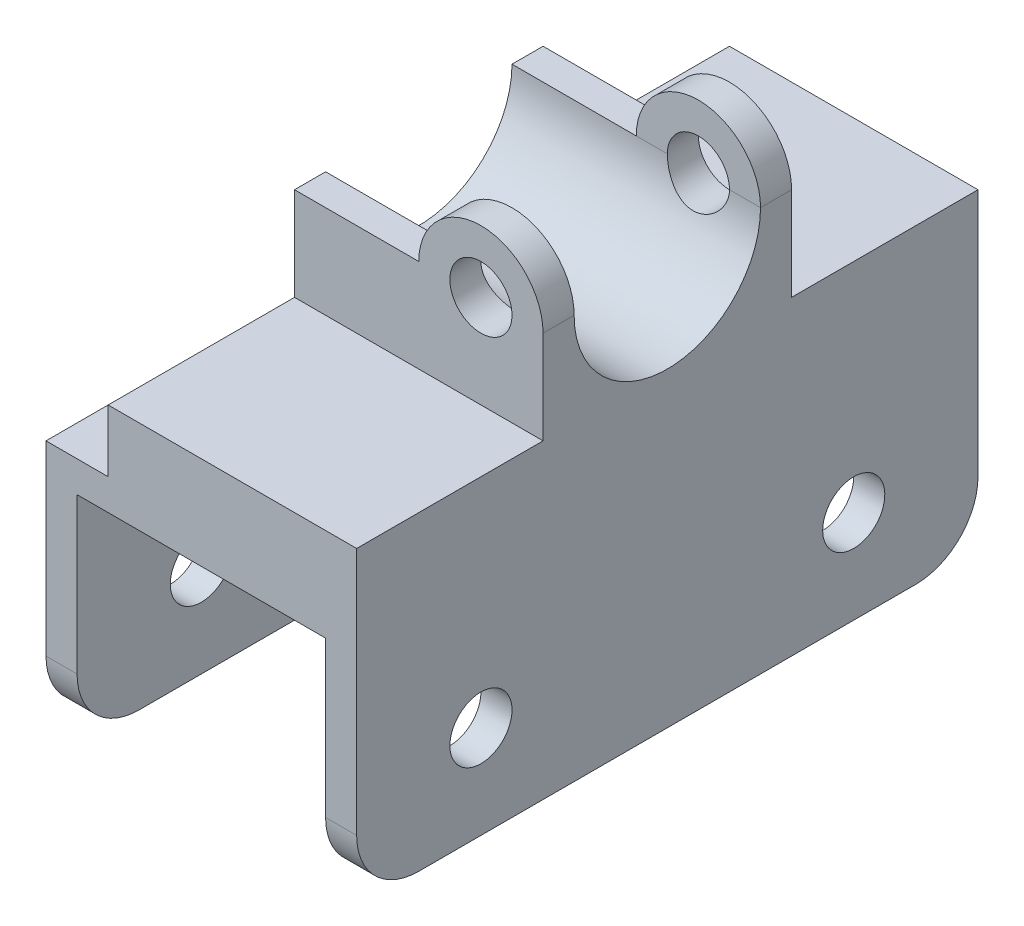
ISO-10303-21;
HEADER;
FILE_DESCRIPTION(('STEP AP214'),'2;1');
FILE_NAME('part.step','',(''),(''),'','','');
FILE_SCHEMA(('AUTOMOTIVE_DESIGN { 1 0 10303 214 1 1 1 1 }'));
ENDSEC;
DATA;
#1=APPLICATION_CONTEXT('core data for automotive mechanical design processes');
#2=APPLICATION_PROTOCOL_DEFINITION('international standard','automotive_design',2000,#1);
#3=PRODUCT_CONTEXT('',#1,'mechanical');
#4=PRODUCT('Part','Part','',(#3));
#5=PRODUCT_RELATED_PRODUCT_CATEGORY('part','',(#4));
#6=PRODUCT_DEFINITION_FORMATION('','',#4);
#7=PRODUCT_DEFINITION_CONTEXT('part definition',#1,'design');
#8=PRODUCT_DEFINITION('design','',#6,#7);
#9=PRODUCT_DEFINITION_SHAPE('','',#8);
#10=(LENGTH_UNIT() NAMED_UNIT(*) SI_UNIT(.MILLI.,.METRE.));
#11=(NAMED_UNIT(*) PLANE_ANGLE_UNIT() SI_UNIT($,.RADIAN.));
#12=(NAMED_UNIT(*) SI_UNIT($,.STERADIAN.) SOLID_ANGLE_UNIT());
#13=UNCERTAINTY_MEASURE_WITH_UNIT(LENGTH_MEASURE(1.E-05),#10,'distance_accuracy_value','');
#14=(GEOMETRIC_REPRESENTATION_CONTEXT(3) GLOBAL_UNCERTAINTY_ASSIGNED_CONTEXT((#13)) GLOBAL_UNIT_ASSIGNED_CONTEXT((#10,
#11,#12)) REPRESENTATION_CONTEXT('',''));
#15=CARTESIAN_POINT('',(0.,0.,0.));
#16=DIRECTION('',(0.,0.,1.));
#17=DIRECTION('',(1.,0.,0.));
#18=AXIS2_PLACEMENT_3D('',#15,#16,#17);
#19=CARTESIAN_POINT('',(40.,65.,100.));
#20=DIRECTION('',(0.,0.,-1.));
#21=DIRECTION('',(-1.,0.,0.));
#22=AXIS2_PLACEMENT_3D('',#19,#20,#21);
#23=CYLINDRICAL_SURFACE('',#22,9.99999999999999);
#24=DIRECTION('',(0.,0.,-1.));
#25=VECTOR('',#24,1.);
#26=CARTESIAN_POINT('',(50.,65.,100.));
#27=LINE('',#26,#25);
#28=CARTESIAN_POINT('',(50.,65.,70.));
#29=VERTEX_POINT('',#28);
#30=CARTESIAN_POINT('',(50.,65.,65.));
#31=VERTEX_POINT('',#30);
#32=EDGE_CURVE('E271',#29,#31,#27,.T.);
#33=ORIENTED_EDGE('',*,*,#32,.T.);
#34=CARTESIAN_POINT('',(40.,65.,65.));
#35=DIRECTION('',(0.,0.,1.));
#36=DIRECTION('',(1.,0.,0.));
#37=AXIS2_PLACEMENT_3D('',#34,#35,#36);
#38=CIRCLE('',#37,9.99999999999999);
#39=CARTESIAN_POINT('',(30.,65.,65.));
#40=VERTEX_POINT('',#39);
#41=EDGE_CURVE('E329',#31,#40,#38,.T.);
#42=ORIENTED_EDGE('',*,*,#41,.T.);
#43=DIRECTION('',(0.,0.,-1.));
#44=VECTOR('',#43,1.);
#45=CARTESIAN_POINT('',(30.,65.,100.));
#46=LINE('',#45,#44);
#47=CARTESIAN_POINT('',(30.,65.,70.));
#48=VERTEX_POINT('',#47);
#49=EDGE_CURVE('E266',#48,#40,#46,.T.);
#50=ORIENTED_EDGE('',*,*,#49,.F.);
#51=CARTESIAN_POINT('',(40.,65.,70.));
#52=DIRECTION('',(0.,0.,-1.));
#53=DIRECTION('',(-1.,0.,0.));
#54=AXIS2_PLACEMENT_3D('',#51,#52,#53);
#55=CIRCLE('',#54,9.99999999999999);
#56=EDGE_CURVE('E436',#48,#29,#55,.T.);
#57=ORIENTED_EDGE('',*,*,#56,.T.);
#58=EDGE_LOOP('',(#33,#42,#50,#57));
#59=FACE_BOUND('',#58,.T.);
#60=ADVANCED_FACE('F40',(#59),#23,.T.);
#61=CARTESIAN_POINT('',(0.,65.,100.));
#62=DIRECTION('',(0.,1.,0.));
#63=DIRECTION('',(0.,0.,1.));
#64=AXIS2_PLACEMENT_3D('',#61,#62,#63);
#65=PLANE('',#64);
#66=DIRECTION('',(0.,0.,1.));
#67=VECTOR('',#66,1.);
#68=CARTESIAN_POINT('',(10.,65.,-1.2E-05));
#69=LINE('',#68,#67);
#70=CARTESIAN_POINT('',(10.,65.,65.));
#71=VERTEX_POINT('',#70);
#72=CARTESIAN_POINT('',(10.,65.,70.));
#73=VERTEX_POINT('',#72);
#74=EDGE_CURVE('E56',#71,#73,#69,.T.);
#75=ORIENTED_EDGE('',*,*,#74,.T.);
#76=DIRECTION('',(-1.,0.,0.));
#77=VECTOR('',#76,1.);
#78=CARTESIAN_POINT('',(0.,65.,70.));
#79=LINE('',#78,#77);
#80=EDGE_CURVE('E283',#48,#73,#79,.T.);
#81=ORIENTED_EDGE('',*,*,#80,.F.);
#82=ORIENTED_EDGE('',*,*,#49,.T.);
#83=DIRECTION('',(1.,0.,0.));
#84=VECTOR('',#83,1.);
#85=CARTESIAN_POINT('',(-50.,65.,65.));
#86=LINE('',#85,#84);
#87=EDGE_CURVE('E452',#71,#40,#86,.T.);
#88=ORIENTED_EDGE('',*,*,#87,.F.);
#89=EDGE_LOOP('',(#75,#81,#82,#88));
#90=FACE_BOUND('',#89,.T.);
#91=ADVANCED_FACE('F573',(#90),#65,.T.);
#92=CARTESIAN_POINT('',(50.,0.,100.));
#93=DIRECTION('',(-1.,0.,0.));
#94=DIRECTION('',(0.,0.,1.));
#95=AXIS2_PLACEMENT_3D('',#92,#93,#94);
#96=PLANE('',#95);
#97=CARTESIAN_POINT('',(50.,15.,20.));
#98=DIRECTION('',(1.,0.,0.));
#99=DIRECTION('',(0.,0.,1.));
#100=AXIS2_PLACEMENT_3D('',#97,#98,#99);
#101=CIRCLE('',#100,5.);
#102=CARTESIAN_POINT('',(50.,15.,25.));
#103=VERTEX_POINT('',#102);
#104=EDGE_CURVE('E453',#103,#103,#101,.T.);
#105=ORIENTED_EDGE('',*,*,#104,.F.);
#106=EDGE_LOOP('',(#105));
#107=FACE_BOUND('',#106,.T.);
#108=CARTESIAN_POINT('',(50.,15.,80.));
#109=DIRECTION('',(1.,0.,0.));
#110=DIRECTION('',(0.,0.,-1.));
#111=AXIS2_PLACEMENT_3D('',#108,#109,#110);
#112=CIRCLE('',#111,5.);
#113=CARTESIAN_POINT('',(50.,15.,75.));
#114=VERTEX_POINT('',#113);
#115=EDGE_CURVE('E457',#114,#114,#112,.T.);
#116=ORIENTED_EDGE('',*,*,#115,.F.);
#117=EDGE_LOOP('',(#116));
#118=FACE_BOUND('',#117,.T.);
#119=DIRECTION('',(0.,0.,-1.));
#120=VECTOR('',#119,1.);
#121=CARTESIAN_POINT('',(50.,0.,100.));
#122=LINE('',#121,#120);
#123=CARTESIAN_POINT('',(50.,0.,90.));
#124=VERTEX_POINT('',#123);
#125=CARTESIAN_POINT('',(50.,0.,9.99999999999999));
#126=VERTEX_POINT('',#125);
#127=EDGE_CURVE('E246',#124,#126,#122,.T.);
#128=ORIENTED_EDGE('',*,*,#127,.T.);
#129=CARTESIAN_POINT('',(50.,10.,9.99999999999999));
#130=DIRECTION('',(-1.,0.,0.));
#131=DIRECTION('',(0.,0.,1.));
#132=AXIS2_PLACEMENT_3D('',#129,#130,#131);
#133=CIRCLE('',#132,10.);
#134=CARTESIAN_POINT('',(50.,10.,0.));
#135=VERTEX_POINT('',#134);
#136=EDGE_CURVE('E375',#126,#135,#133,.F.);
#137=ORIENTED_EDGE('',*,*,#136,.T.);
#138=DIRECTION('',(0.,1.,0.));
#139=VECTOR('',#138,1.);
#140=CARTESIAN_POINT('',(50.,0.,0.));
#141=LINE('',#140,#139);
#142=CARTESIAN_POINT('',(50.,50.,0.));
#143=VERTEX_POINT('',#142);
#144=EDGE_CURVE('E231',#135,#143,#141,.T.);
#145=ORIENTED_EDGE('',*,*,#144,.T.);
#146=DIRECTION('',(0.,0.,-1.));
#147=VECTOR('',#146,1.);
#148=CARTESIAN_POINT('',(50.,50.,0.));
#149=LINE('',#148,#147);
#150=CARTESIAN_POINT('',(50.,50.,30.));
#151=VERTEX_POINT('',#150);
#152=EDGE_CURVE('E467',#151,#143,#149,.T.);
#153=ORIENTED_EDGE('',*,*,#152,.F.);
#154=DIRECTION('',(0.,-1.,0.));
#155=VECTOR('',#154,1.);
#156=CARTESIAN_POINT('',(50.,75.,30.));
#157=LINE('',#156,#155);
#158=CARTESIAN_POINT('',(50.,65.,30.));
#159=VERTEX_POINT('',#158);
#160=EDGE_CURVE('E462',#159,#151,#157,.T.);
#161=ORIENTED_EDGE('',*,*,#160,.F.);
#162=CARTESIAN_POINT('',(50.,65.,35.));
#163=VERTEX_POINT('',#162);
#164=EDGE_CURVE('E267',#163,#159,#27,.T.);
#165=ORIENTED_EDGE('',*,*,#164,.F.);
#166=CARTESIAN_POINT('',(50.,65.,50.));
#167=DIRECTION('',(1.,0.,0.));
#168=DIRECTION('',(0.,0.,-1.));
#169=AXIS2_PLACEMENT_3D('',#166,#167,#168);
#170=CIRCLE('',#169,15.);
#171=EDGE_CURVE('E466',#31,#163,#170,.T.);
#172=ORIENTED_EDGE('',*,*,#171,.F.);
#173=ORIENTED_EDGE('',*,*,#32,.F.);
#174=DIRECTION('',(0.,1.,0.));
#175=VECTOR('',#174,1.);
#176=CARTESIAN_POINT('',(50.,75.,70.));
#177=LINE('',#176,#175);
#178=CARTESIAN_POINT('',(50.,50.,70.));
#179=VERTEX_POINT('',#178);
#180=EDGE_CURVE('E444',#179,#29,#177,.T.);
#181=ORIENTED_EDGE('',*,*,#180,.F.);
#182=DIRECTION('',(0.,0.,-1.));
#183=VECTOR('',#182,1.);
#184=CARTESIAN_POINT('',(50.,50.,100.));
#185=LINE('',#184,#183);
#186=CARTESIAN_POINT('',(50.,50.,100.));
#187=VERTEX_POINT('',#186);
#188=EDGE_CURVE('E448',#187,#179,#185,.T.);
#189=ORIENTED_EDGE('',*,*,#188,.F.);
#190=DIRECTION('',(0.,1.,0.));
#191=VECTOR('',#190,1.);
#192=CARTESIAN_POINT('',(50.,0.,100.));
#193=LINE('',#192,#191);
#194=CARTESIAN_POINT('',(50.,10.,100.));
#195=VERTEX_POINT('',#194);
#196=EDGE_CURVE('E245',#195,#187,#193,.T.);
#197=ORIENTED_EDGE('',*,*,#196,.F.);
#198=CARTESIAN_POINT('',(50.,10.,90.));
#199=DIRECTION('',(-1.,0.,0.));
#200=DIRECTION('',(0.,0.,1.));
#201=AXIS2_PLACEMENT_3D('',#198,#199,#200);
#202=CIRCLE('',#201,10.);
#203=EDGE_CURVE('E372',#195,#124,#202,.F.);
#204=ORIENTED_EDGE('',*,*,#203,.T.);
#205=EDGE_LOOP('',(#128,#137,#145,#153,#161,#165,#172,#173,#181,#189,#197,#204));
#206=FACE_BOUND('',#205,.T.);
#207=ADVANCED_FACE('F536',(#107,#118,#206),#96,.F.);
#208=ORIENTED_EDGE('',*,*,#164,.T.);
#209=CARTESIAN_POINT('',(40.,65.,30.));
#210=DIRECTION('',(0.,0.,1.));
#211=DIRECTION('',(0.,-1.,0.));
#212=AXIS2_PLACEMENT_3D('',#209,#210,#211);
#213=CIRCLE('',#212,9.99999999999999);
#214=CARTESIAN_POINT('',(30.,65.,30.));
#215=VERTEX_POINT('',#214);
#216=EDGE_CURVE('E335',#159,#215,#213,.T.);
#217=ORIENTED_EDGE('',*,*,#216,.T.);
#218=CARTESIAN_POINT('',(30.,65.,35.));
#219=VERTEX_POINT('',#218);
#220=EDGE_CURVE('E262',#219,#215,#46,.T.);
#221=ORIENTED_EDGE('',*,*,#220,.F.);
#222=CARTESIAN_POINT('',(40.,65.,35.));
#223=DIRECTION('',(0.,0.,-1.));
#224=DIRECTION('',(-1.,0.,0.));
#225=AXIS2_PLACEMENT_3D('',#222,#223,#224);
#226=CIRCLE('',#225,9.99999999999999);
#227=EDGE_CURVE('E433',#219,#163,#226,.T.);
#228=ORIENTED_EDGE('',*,*,#227,.T.);
#229=EDGE_LOOP('',(#208,#217,#221,#228));
#230=FACE_BOUND('',#229,.T.);
#231=ADVANCED_FACE('F576',(#230),#23,.T.);
#232=CARTESIAN_POINT('',(10.,65.,30.));
#233=VERTEX_POINT('',#232);
#234=CARTESIAN_POINT('',(10.,65.,35.));
#235=VERTEX_POINT('',#234);
#236=EDGE_CURVE('E518',#233,#235,#69,.T.);
#237=ORIENTED_EDGE('',*,*,#236,.T.);
#238=DIRECTION('',(1.,0.,0.));
#239=VECTOR('',#238,1.);
#240=CARTESIAN_POINT('',(-50.,65.,35.));
#241=LINE('',#240,#239);
#242=EDGE_CURVE('E479',#235,#219,#241,.T.);
#243=ORIENTED_EDGE('',*,*,#242,.T.);
#244=ORIENTED_EDGE('',*,*,#220,.T.);
#245=DIRECTION('',(1.,0.,0.));
#246=VECTOR('',#245,1.);
#247=CARTESIAN_POINT('',(0.,65.,30.));
#248=LINE('',#247,#246);
#249=EDGE_CURVE('E328',#233,#215,#248,.T.);
#250=ORIENTED_EDGE('',*,*,#249,.F.);
#251=EDGE_LOOP('',(#237,#243,#244,#250));
#252=FACE_BOUND('',#251,.T.);
#253=ADVANCED_FACE('F582',(#252),#65,.T.);
#254=CARTESIAN_POINT('',(0.,0.,100.));
#255=DIRECTION('',(-1.,0.,0.));
#256=DIRECTION('',(0.,0.,1.));
#257=AXIS2_PLACEMENT_3D('',#254,#255,#256);
#258=PLANE('',#257);
#259=DIRECTION('',(0.,0.,1.));
#260=VECTOR('',#259,1.);
#261=CARTESIAN_POINT('',(0.,40.,0.));
#262=LINE('',#261,#260);
#263=CARTESIAN_POINT('',(0.,40.,0.));
#264=VERTEX_POINT('',#263);
#265=CARTESIAN_POINT('',(0.,40.,100.));
#266=VERTEX_POINT('',#265);
#267=EDGE_CURVE('E205',#264,#266,#262,.T.);
#268=ORIENTED_EDGE('',*,*,#267,.F.);
#269=DIRECTION('',(0.,1.,0.));
#270=VECTOR('',#269,1.);
#271=CARTESIAN_POINT('',(0.,0.,0.));
#272=LINE('',#271,#270);
#273=CARTESIAN_POINT('',(0.,10.,0.));
#274=VERTEX_POINT('',#273);
#275=EDGE_CURVE('E219',#274,#264,#272,.T.);
#276=ORIENTED_EDGE('',*,*,#275,.F.);
#277=CARTESIAN_POINT('',(0.,10.,9.99999999999999));
#278=DIRECTION('',(-1.,0.,0.));
#279=DIRECTION('',(0.,0.,1.));
#280=AXIS2_PLACEMENT_3D('',#277,#278,#279);
#281=CIRCLE('',#280,10.);
#282=CARTESIAN_POINT('',(0.,0.,9.99999999999999));
#283=VERTEX_POINT('',#282);
#284=EDGE_CURVE('E362',#274,#283,#281,.T.);
#285=ORIENTED_EDGE('',*,*,#284,.T.);
#286=DIRECTION('',(0.,0.,-1.));
#287=VECTOR('',#286,1.);
#288=CARTESIAN_POINT('',(0.,0.,100.));
#289=LINE('',#288,#287);
#290=CARTESIAN_POINT('',(0.,0.,90.));
#291=VERTEX_POINT('',#290);
#292=EDGE_CURVE('E258',#291,#283,#289,.T.);
#293=ORIENTED_EDGE('',*,*,#292,.F.);
#294=CARTESIAN_POINT('',(0.,10.,90.));
#295=DIRECTION('',(-1.,0.,0.));
#296=DIRECTION('',(0.,0.,1.));
#297=AXIS2_PLACEMENT_3D('',#294,#295,#296);
#298=CIRCLE('',#297,10.);
#299=CARTESIAN_POINT('',(0.,10.,100.));
#300=VERTEX_POINT('',#299);
#301=EDGE_CURVE('E359',#291,#300,#298,.T.);
#302=ORIENTED_EDGE('',*,*,#301,.T.);
#303=DIRECTION('',(0.,1.,0.));
#304=VECTOR('',#303,1.);
#305=CARTESIAN_POINT('',(0.,0.,100.));
#306=LINE('',#305,#304);
#307=EDGE_CURVE('E222',#300,#266,#306,.T.);
#308=ORIENTED_EDGE('',*,*,#307,.T.);
#309=EDGE_LOOP('',(#268,#276,#285,#293,#302,#308));
#310=FACE_BOUND('',#309,.T.);
#311=CARTESIAN_POINT('',(0.,15.,20.));
#312=DIRECTION('',(-1.,0.,0.));
#313=DIRECTION('',(0.,0.,1.));
#314=AXIS2_PLACEMENT_3D('',#311,#312,#313);
#315=CIRCLE('',#314,5.);
#316=CARTESIAN_POINT('',(0.,15.,25.));
#317=VERTEX_POINT('',#316);
#318=EDGE_CURVE('E238',#317,#317,#315,.T.);
#319=ORIENTED_EDGE('',*,*,#318,.F.);
#320=EDGE_LOOP('',(#319));
#321=FACE_BOUND('',#320,.T.);
#322=CARTESIAN_POINT('',(0.,15.,80.));
#323=DIRECTION('',(-1.,0.,0.));
#324=DIRECTION('',(0.,0.,1.));
#325=AXIS2_PLACEMENT_3D('',#322,#323,#324);
#326=CIRCLE('',#325,5.);
#327=CARTESIAN_POINT('',(0.,15.,85.));
#328=VERTEX_POINT('',#327);
#329=EDGE_CURVE('E341',#328,#328,#326,.T.);
#330=ORIENTED_EDGE('',*,*,#329,.F.);
#331=EDGE_LOOP('',(#330));
#332=FACE_BOUND('',#331,.T.);
#333=ADVANCED_FACE('F217',(#310,#321,#332),#258,.T.);
#334=CARTESIAN_POINT('',(0.,0.,100.));
#335=DIRECTION('',(0.,1.,0.));
#336=DIRECTION('',(0.,0.,1.));
#337=AXIS2_PLACEMENT_3D('',#334,#335,#336);
#338=PLANE('',#337);
#339=ORIENTED_EDGE('',*,*,#292,.T.);
#340=DIRECTION('',(1.,0.,0.));
#341=VECTOR('',#340,1.);
#342=CARTESIAN_POINT('',(0.,0.,9.99999999999999));
#343=LINE('',#342,#341);
#344=CARTESIAN_POINT('',(5.,0.,9.99999999999999));
#345=VERTEX_POINT('',#344);
#346=EDGE_CURVE('E344',#283,#345,#343,.T.);
#347=ORIENTED_EDGE('',*,*,#346,.T.);
#348=DIRECTION('',(0.,0.,-1.));
#349=VECTOR('',#348,1.);
#350=CARTESIAN_POINT('',(5.,0.,100.));
#351=LINE('',#350,#349);
#352=CARTESIAN_POINT('',(5.,0.,90.));
#353=VERTEX_POINT('',#352);
#354=EDGE_CURVE('E254',#353,#345,#351,.T.);
#355=ORIENTED_EDGE('',*,*,#354,.F.);
#356=DIRECTION('',(1.,0.,0.));
#357=VECTOR('',#356,1.);
#358=CARTESIAN_POINT('',(0.,0.,90.));
#359=LINE('',#358,#357);
#360=EDGE_CURVE('E323',#353,#291,#359,.F.);
#361=ORIENTED_EDGE('',*,*,#360,.T.);
#362=EDGE_LOOP('',(#339,#347,#355,#361));
#363=FACE_BOUND('',#362,.T.);
#364=ADVANCED_FACE('F563',(#363),#338,.F.);
#365=CARTESIAN_POINT('',(5.,0.,100.));
#366=DIRECTION('',(-1.,0.,0.));
#367=DIRECTION('',(0.,0.,1.));
#368=AXIS2_PLACEMENT_3D('',#365,#366,#367);
#369=PLANE('',#368);
#370=CARTESIAN_POINT('',(5.,15.,20.));
#371=DIRECTION('',(-1.,0.,0.));
#372=DIRECTION('',(0.,0.,1.));
#373=AXIS2_PLACEMENT_3D('',#370,#371,#372);
#374=CIRCLE('',#373,5.);
#375=CARTESIAN_POINT('',(5.,15.,25.));
#376=VERTEX_POINT('',#375);
#377=EDGE_CURVE('E340',#376,#376,#374,.T.);
#378=ORIENTED_EDGE('',*,*,#377,.T.);
#379=EDGE_LOOP('',(#378));
#380=FACE_BOUND('',#379,.T.);
#381=CARTESIAN_POINT('',(5.,15.,80.));
#382=DIRECTION('',(-1.,0.,0.));
#383=DIRECTION('',(0.,0.,1.));
#384=AXIS2_PLACEMENT_3D('',#381,#382,#383);
#385=CIRCLE('',#384,5.);
#386=CARTESIAN_POINT('',(5.,15.,85.));
#387=VERTEX_POINT('',#386);
#388=EDGE_CURVE('E334',#387,#387,#385,.T.);
#389=ORIENTED_EDGE('',*,*,#388,.T.);
#390=EDGE_LOOP('',(#389));
#391=FACE_BOUND('',#390,.T.);
#392=DIRECTION('',(0.,1.,0.));
#393=VECTOR('',#392,1.);
#394=CARTESIAN_POINT('',(5.,0.,0.));
#395=LINE('',#394,#393);
#396=CARTESIAN_POINT('',(5.,10.,0.));
#397=VERTEX_POINT('',#396);
#398=CARTESIAN_POINT('',(5.,35.,0.));
#399=VERTEX_POINT('',#398);
#400=EDGE_CURVE('E230',#397,#399,#395,.T.);
#401=ORIENTED_EDGE('',*,*,#400,.T.);
#402=DIRECTION('',(0.,0.,-1.));
#403=VECTOR('',#402,1.);
#404=CARTESIAN_POINT('',(5.,35.,100.));
#405=LINE('',#404,#403);
#406=CARTESIAN_POINT('',(5.,35.,100.));
#407=VERTEX_POINT('',#406);
#408=EDGE_CURVE('E403',#407,#399,#405,.T.);
#409=ORIENTED_EDGE('',*,*,#408,.F.);
#410=DIRECTION('',(0.,1.,0.));
#411=VECTOR('',#410,1.);
#412=CARTESIAN_POINT('',(5.,0.,100.));
#413=LINE('',#412,#411);
#414=CARTESIAN_POINT('',(5.,10.,100.));
#415=VERTEX_POINT('',#414);
#416=EDGE_CURVE('E395',#415,#407,#413,.T.);
#417=ORIENTED_EDGE('',*,*,#416,.F.);
#418=CARTESIAN_POINT('',(5.,10.,90.));
#419=DIRECTION('',(-1.,0.,0.));
#420=DIRECTION('',(0.,0.,1.));
#421=AXIS2_PLACEMENT_3D('',#418,#419,#420);
#422=CIRCLE('',#421,10.);
#423=EDGE_CURVE('E348',#415,#353,#422,.F.);
#424=ORIENTED_EDGE('',*,*,#423,.T.);
#425=ORIENTED_EDGE('',*,*,#354,.T.);
#426=CARTESIAN_POINT('',(5.,10.,9.99999999999999));
#427=DIRECTION('',(-1.,0.,0.));
#428=DIRECTION('',(0.,0.,1.));
#429=AXIS2_PLACEMENT_3D('',#426,#427,#428);
#430=CIRCLE('',#429,10.);
#431=EDGE_CURVE('E351',#345,#397,#430,.F.);
#432=ORIENTED_EDGE('',*,*,#431,.T.);
#433=EDGE_LOOP('',(#401,#409,#417,#424,#425,#432));
#434=FACE_BOUND('',#433,.T.);
#435=ADVANCED_FACE('F400',(#380,#391,#434),#369,.F.);
#436=CARTESIAN_POINT('',(45.,0.,100.));
#437=DIRECTION('',(-1.,0.,0.));
#438=DIRECTION('',(0.,-1.,0.));
#439=AXIS2_PLACEMENT_3D('',#436,#437,#438);
#440=PLANE('',#439);
#441=DIRECTION('',(0.,0.,1.));
#442=VECTOR('',#441,1.);
#443=CARTESIAN_POINT('',(45.,35.,100.));
#444=LINE('',#443,#442);
#445=CARTESIAN_POINT('',(45.,35.,0.));
#446=VERTEX_POINT('',#445);
#447=CARTESIAN_POINT('',(45.,35.,100.));
#448=VERTEX_POINT('',#447);
#449=EDGE_CURVE('E490',#446,#448,#444,.T.);
#450=ORIENTED_EDGE('',*,*,#449,.F.);
#451=DIRECTION('',(0.,1.,0.));
#452=VECTOR('',#451,1.);
#453=CARTESIAN_POINT('',(45.,0.,0.));
#454=LINE('',#453,#452);
#455=CARTESIAN_POINT('',(45.,10.,0.));
#456=VERTEX_POINT('',#455);
#457=EDGE_CURVE('E235',#456,#446,#454,.T.);
#458=ORIENTED_EDGE('',*,*,#457,.F.);
#459=CARTESIAN_POINT('',(45.,10.,9.99999999999999));
#460=DIRECTION('',(-1.,0.,0.));
#461=DIRECTION('',(0.,-1.,0.));
#462=AXIS2_PLACEMENT_3D('',#459,#460,#461);
#463=CIRCLE('',#462,10.);
#464=CARTESIAN_POINT('',(45.,0.,9.99999999999999));
#465=VERTEX_POINT('',#464);
#466=EDGE_CURVE('E381',#456,#465,#463,.T.);
#467=ORIENTED_EDGE('',*,*,#466,.T.);
#468=DIRECTION('',(0.,0.,-1.));
#469=VECTOR('',#468,1.);
#470=CARTESIAN_POINT('',(45.,0.,100.));
#471=LINE('',#470,#469);
#472=CARTESIAN_POINT('',(45.,0.,90.));
#473=VERTEX_POINT('',#472);
#474=EDGE_CURVE('E250',#473,#465,#471,.T.);
#475=ORIENTED_EDGE('',*,*,#474,.F.);
#476=CARTESIAN_POINT('',(45.,10.,90.));
#477=DIRECTION('',(-1.,0.,0.));
#478=DIRECTION('',(0.,-1.,0.));
#479=AXIS2_PLACEMENT_3D('',#476,#477,#478);
#480=CIRCLE('',#479,10.);
#481=CARTESIAN_POINT('',(45.,10.,100.));
#482=VERTEX_POINT('',#481);
#483=EDGE_CURVE('E378',#473,#482,#480,.T.);
#484=ORIENTED_EDGE('',*,*,#483,.T.);
#485=DIRECTION('',(0.,1.,0.));
#486=VECTOR('',#485,1.);
#487=CARTESIAN_POINT('',(45.,0.,100.));
#488=LINE('',#487,#486);
#489=EDGE_CURVE('E63',#482,#448,#488,.T.);
#490=ORIENTED_EDGE('',*,*,#489,.T.);
#491=EDGE_LOOP('',(#450,#458,#467,#475,#484,#490));
#492=FACE_BOUND('',#491,.T.);
#493=CARTESIAN_POINT('',(45.,15.,20.));
#494=DIRECTION('',(-1.,0.,0.));
#495=DIRECTION('',(0.,-1.,0.));
#496=AXIS2_PLACEMENT_3D('',#493,#494,#495);
#497=CIRCLE('',#496,5.);
#498=CARTESIAN_POINT('',(45.,9.99999999999999,20.));
#499=VERTEX_POINT('',#498);
#500=EDGE_CURVE('E336',#499,#499,#497,.T.);
#501=ORIENTED_EDGE('',*,*,#500,.F.);
#502=EDGE_LOOP('',(#501));
#503=FACE_BOUND('',#502,.T.);
#504=CARTESIAN_POINT('',(45.,15.,80.));
#505=DIRECTION('',(-1.,0.,0.));
#506=DIRECTION('',(0.,-1.,0.));
#507=AXIS2_PLACEMENT_3D('',#504,#505,#506);
#508=CIRCLE('',#507,5.);
#509=CARTESIAN_POINT('',(45.,9.99999999999999,80.));
#510=VERTEX_POINT('',#509);
#511=EDGE_CURVE('E330',#510,#510,#508,.T.);
#512=ORIENTED_EDGE('',*,*,#511,.F.);
#513=EDGE_LOOP('',(#512));
#514=FACE_BOUND('',#513,.T.);
#515=ADVANCED_FACE('F545',(#492,#503,#514),#440,.T.);
#516=CARTESIAN_POINT('',(0.,0.,100.));
#517=DIRECTION('',(0.,1.,0.));
#518=DIRECTION('',(0.,0.,1.));
#519=AXIS2_PLACEMENT_3D('',#516,#517,#518);
#520=PLANE('',#519);
#521=ORIENTED_EDGE('',*,*,#474,.T.);
#522=DIRECTION('',(1.,0.,0.));
#523=VECTOR('',#522,1.);
#524=CARTESIAN_POINT('',(0.,0.,9.99999999999999));
#525=LINE('',#524,#523);
#526=EDGE_CURVE('E368',#465,#126,#525,.T.);
#527=ORIENTED_EDGE('',*,*,#526,.T.);
#528=ORIENTED_EDGE('',*,*,#127,.F.);
#529=DIRECTION('',(1.,0.,0.));
#530=VECTOR('',#529,1.);
#531=CARTESIAN_POINT('',(45.,0.,90.));
#532=LINE('',#531,#530);
#533=EDGE_CURVE('E365',#124,#473,#532,.F.);
#534=ORIENTED_EDGE('',*,*,#533,.T.);
#535=EDGE_LOOP('',(#521,#527,#528,#534));
#536=FACE_BOUND('',#535,.T.);
#537=ADVANCED_FACE('F549',(#536),#520,.F.);
#538=CARTESIAN_POINT('',(0.,0.,100.));
#539=DIRECTION('',(0.,0.,1.));
#540=DIRECTION('',(1.,0.,0.));
#541=AXIS2_PLACEMENT_3D('',#538,#539,#540);
#542=PLANE('',#541);
#543=DIRECTION('',(0.,1.,0.));
#544=VECTOR('',#543,1.);
#545=CARTESIAN_POINT('',(10.,65.,100.));
#546=LINE('',#545,#544);
#547=CARTESIAN_POINT('',(10.,40.,100.));
#548=VERTEX_POINT('',#547);
#549=CARTESIAN_POINT('',(10.,50.,100.));
#550=VERTEX_POINT('',#549);
#551=EDGE_CURVE('E521',#548,#550,#546,.T.);
#552=ORIENTED_EDGE('',*,*,#551,.F.);
#553=DIRECTION('',(1.,0.,0.));
#554=VECTOR('',#553,1.);
#555=CARTESIAN_POINT('',(0.,40.,100.));
#556=LINE('',#555,#554);
#557=EDGE_CURVE('E524',#266,#548,#556,.T.);
#558=ORIENTED_EDGE('',*,*,#557,.F.);
#559=ORIENTED_EDGE('',*,*,#307,.F.);
#560=DIRECTION('',(1.,0.,0.));
#561=VECTOR('',#560,1.);
#562=CARTESIAN_POINT('',(5.,10.,100.));
#563=LINE('',#562,#561);
#564=EDGE_CURVE('E49',#300,#415,#563,.T.);
#565=ORIENTED_EDGE('',*,*,#564,.T.);
#566=ORIENTED_EDGE('',*,*,#416,.T.);
#567=DIRECTION('',(-1.,0.,0.));
#568=VECTOR('',#567,1.);
#569=CARTESIAN_POINT('',(5.,35.,100.));
#570=LINE('',#569,#568);
#571=EDGE_CURVE('E458',#448,#407,#570,.T.);
#572=ORIENTED_EDGE('',*,*,#571,.F.);
#573=ORIENTED_EDGE('',*,*,#489,.F.);
#574=DIRECTION('',(1.,0.,0.));
#575=VECTOR('',#574,1.);
#576=CARTESIAN_POINT('',(50.,10.,100.));
#577=LINE('',#576,#575);
#578=EDGE_CURVE('E384',#482,#195,#577,.T.);
#579=ORIENTED_EDGE('',*,*,#578,.T.);
#580=ORIENTED_EDGE('',*,*,#196,.T.);
#581=DIRECTION('',(1.,0.,0.));
#582=VECTOR('',#581,1.);
#583=CARTESIAN_POINT('',(0.,50.,100.));
#584=LINE('',#583,#582);
#585=EDGE_CURVE('E275',#550,#187,#584,.T.);
#586=ORIENTED_EDGE('',*,*,#585,.F.);
#587=EDGE_LOOP('',(#552,#558,#559,#565,#566,#572,#573,#579,#580,#586));
#588=FACE_BOUND('',#587,.T.);
#589=ADVANCED_FACE('F393',(#588),#542,.T.);
#590=CARTESIAN_POINT('',(0.,0.,0.));
#591=DIRECTION('',(0.,0.,1.));
#592=DIRECTION('',(1.,0.,0.));
#593=AXIS2_PLACEMENT_3D('',#590,#591,#592);
#594=PLANE('',#593);
#595=DIRECTION('',(1.,0.,0.));
#596=VECTOR('',#595,1.);
#597=CARTESIAN_POINT('',(0.,40.,0.));
#598=LINE('',#597,#596);
#599=CARTESIAN_POINT('',(10.,40.,0.));
#600=VERTEX_POINT('',#599);
#601=EDGE_CURVE('E201',#264,#600,#598,.T.);
#602=ORIENTED_EDGE('',*,*,#601,.T.);
#603=DIRECTION('',(0.,1.,0.));
#604=VECTOR('',#603,1.);
#605=CARTESIAN_POINT('',(10.,0.,0.));
#606=LINE('',#605,#604);
#607=CARTESIAN_POINT('',(10.,50.,0.));
#608=VERTEX_POINT('',#607);
#609=EDGE_CURVE('E499',#600,#608,#606,.T.);
#610=ORIENTED_EDGE('',*,*,#609,.T.);
#611=DIRECTION('',(1.,0.,0.));
#612=VECTOR('',#611,1.);
#613=CARTESIAN_POINT('',(0.,50.,0.));
#614=LINE('',#613,#612);
#615=EDGE_CURVE('E272',#608,#143,#614,.T.);
#616=ORIENTED_EDGE('',*,*,#615,.T.);
#617=ORIENTED_EDGE('',*,*,#144,.F.);
#618=DIRECTION('',(1.,0.,0.));
#619=VECTOR('',#618,1.);
#620=CARTESIAN_POINT('',(0.,10.,0.));
#621=LINE('',#620,#619);
#622=EDGE_CURVE('E354',#135,#456,#621,.F.);
#623=ORIENTED_EDGE('',*,*,#622,.T.);
#624=ORIENTED_EDGE('',*,*,#457,.T.);
#625=DIRECTION('',(1.,0.,0.));
#626=VECTOR('',#625,1.);
#627=CARTESIAN_POINT('',(5.,35.,0.));
#628=LINE('',#627,#626);
#629=EDGE_CURVE('E493',#399,#446,#628,.T.);
#630=ORIENTED_EDGE('',*,*,#629,.F.);
#631=ORIENTED_EDGE('',*,*,#400,.F.);
#632=DIRECTION('',(1.,0.,0.));
#633=VECTOR('',#632,1.);
#634=CARTESIAN_POINT('',(0.,10.,0.));
#635=LINE('',#634,#633);
#636=EDGE_CURVE('E228',#397,#274,#635,.F.);
#637=ORIENTED_EDGE('',*,*,#636,.T.);
#638=ORIENTED_EDGE('',*,*,#275,.T.);
#639=EDGE_LOOP('',(#602,#610,#616,#617,#623,#624,#630,#631,#637,#638));
#640=FACE_BOUND('',#639,.T.);
#641=ADVANCED_FACE('F225',(#640),#594,.F.);
#642=CARTESIAN_POINT('',(-50.,75.,30.));
#643=DIRECTION('',(0.,0.,1.));
#644=DIRECTION('',(0.,-1.,0.));
#645=AXIS2_PLACEMENT_3D('',#642,#643,#644);
#646=PLANE('',#645);
#647=CARTESIAN_POINT('',(40.,65.,30.));
#648=DIRECTION('',(0.,0.,1.));
#649=DIRECTION('',(0.,-1.,0.));
#650=AXIS2_PLACEMENT_3D('',#647,#648,#649);
#651=CIRCLE('',#650,5.);
#652=CARTESIAN_POINT('',(40.,60.,30.));
#653=VERTEX_POINT('',#652);
#654=EDGE_CURVE('E324',#653,#653,#651,.T.);
#655=ORIENTED_EDGE('',*,*,#654,.T.);
#656=EDGE_LOOP('',(#655));
#657=FACE_BOUND('',#656,.T.);
#658=DIRECTION('',(1.,0.,0.));
#659=VECTOR('',#658,1.);
#660=CARTESIAN_POINT('',(-50.,50.,30.));
#661=LINE('',#660,#659);
#662=CARTESIAN_POINT('',(10.,50.,30.));
#663=VERTEX_POINT('',#662);
#664=EDGE_CURVE('E463',#663,#151,#661,.T.);
#665=ORIENTED_EDGE('',*,*,#664,.F.);
#666=DIRECTION('',(0.,1.,0.));
#667=VECTOR('',#666,1.);
#668=CARTESIAN_POINT('',(10.,75.,30.));
#669=LINE('',#668,#667);
#670=EDGE_CURVE('E502',#663,#233,#669,.T.);
#671=ORIENTED_EDGE('',*,*,#670,.T.);
#672=ORIENTED_EDGE('',*,*,#249,.T.);
#673=ORIENTED_EDGE('',*,*,#216,.F.);
#674=ORIENTED_EDGE('',*,*,#160,.T.);
#675=EDGE_LOOP('',(#665,#671,#672,#673,#674));
#676=FACE_BOUND('',#675,.T.);
#677=ADVANCED_FACE('F628',(#657,#676),#646,.F.);
#678=CARTESIAN_POINT('',(-50.,50.,0.));
#679=DIRECTION('',(0.,-1.,0.));
#680=DIRECTION('',(0.,0.,-1.));
#681=AXIS2_PLACEMENT_3D('',#678,#679,#680);
#682=PLANE('',#681);
#683=ORIENTED_EDGE('',*,*,#615,.F.);
#684=DIRECTION('',(0.,0.,1.));
#685=VECTOR('',#684,1.);
#686=CARTESIAN_POINT('',(10.,50.,0.));
#687=LINE('',#686,#685);
#688=EDGE_CURVE('E506',#608,#663,#687,.T.);
#689=ORIENTED_EDGE('',*,*,#688,.T.);
#690=ORIENTED_EDGE('',*,*,#664,.T.);
#691=ORIENTED_EDGE('',*,*,#152,.T.);
#692=EDGE_LOOP('',(#683,#689,#690,#691));
#693=FACE_BOUND('',#692,.T.);
#694=ADVANCED_FACE('F312',(#693),#682,.F.);
#695=CARTESIAN_POINT('',(-50.,75.,70.));
#696=DIRECTION('',(0.,0.,-1.));
#697=DIRECTION('',(-1.,0.,0.));
#698=AXIS2_PLACEMENT_3D('',#695,#696,#697);
#699=PLANE('',#698);
#700=CARTESIAN_POINT('',(40.,65.,70.));
#701=DIRECTION('',(0.,0.,-1.));
#702=DIRECTION('',(-1.,0.,0.));
#703=AXIS2_PLACEMENT_3D('',#700,#701,#702);
#704=CIRCLE('',#703,5.);
#705=CARTESIAN_POINT('',(35.,65.,70.));
#706=VERTEX_POINT('',#705);
#707=EDGE_CURVE('E279',#706,#706,#704,.T.);
#708=ORIENTED_EDGE('',*,*,#707,.T.);
#709=EDGE_LOOP('',(#708));
#710=FACE_BOUND('',#709,.T.);
#711=ORIENTED_EDGE('',*,*,#80,.T.);
#712=DIRECTION('',(0.,-1.,0.));
#713=VECTOR('',#712,1.);
#714=CARTESIAN_POINT('',(10.,75.,70.));
#715=LINE('',#714,#713);
#716=CARTESIAN_POINT('',(10.,50.,70.));
#717=VERTEX_POINT('',#716);
#718=EDGE_CURVE('E510',#73,#717,#715,.T.);
#719=ORIENTED_EDGE('',*,*,#718,.T.);
#720=DIRECTION('',(1.,0.,0.));
#721=VECTOR('',#720,1.);
#722=CARTESIAN_POINT('',(-50.,50.,70.));
#723=LINE('',#722,#721);
#724=EDGE_CURVE('E284',#717,#179,#723,.T.);
#725=ORIENTED_EDGE('',*,*,#724,.T.);
#726=ORIENTED_EDGE('',*,*,#180,.T.);
#727=ORIENTED_EDGE('',*,*,#56,.F.);
#728=EDGE_LOOP('',(#711,#719,#725,#726,#727));
#729=FACE_BOUND('',#728,.T.);
#730=ADVANCED_FACE('F606',(#710,#729),#699,.F.);
#731=CARTESIAN_POINT('',(-50.,50.,100.));
#732=DIRECTION('',(0.,-1.,0.));
#733=DIRECTION('',(0.,0.,-1.));
#734=AXIS2_PLACEMENT_3D('',#731,#732,#733);
#735=PLANE('',#734);
#736=ORIENTED_EDGE('',*,*,#724,.F.);
#737=DIRECTION('',(0.,0.,1.));
#738=VECTOR('',#737,1.);
#739=CARTESIAN_POINT('',(10.,50.,100.));
#740=LINE('',#739,#738);
#741=EDGE_CURVE('E514',#717,#550,#740,.T.);
#742=ORIENTED_EDGE('',*,*,#741,.T.);
#743=ORIENTED_EDGE('',*,*,#585,.T.);
#744=ORIENTED_EDGE('',*,*,#188,.T.);
#745=EDGE_LOOP('',(#736,#742,#743,#744));
#746=FACE_BOUND('',#745,.T.);
#747=ADVANCED_FACE('F610',(#746),#735,.F.);
#748=CARTESIAN_POINT('',(40.,65.,100.));
#749=DIRECTION('',(0.,0.,-1.));
#750=DIRECTION('',(-1.,0.,0.));
#751=AXIS2_PLACEMENT_3D('',#748,#749,#750);
#752=CYLINDRICAL_SURFACE('',#751,5.);
#753=CARTESIAN_POINT('',(35.,65.,65.));
#754=CARTESIAN_POINT('',(34.9999811859052,64.8633748516373,65.0000180575804));
#755=CARTESIAN_POINT('',(35.0055991135657,64.726757113034,64.9981339956647));
#756=CARTESIAN_POINT('',(35.0279687104797,64.4545673063,64.9906934299212));
#757=CARTESIAN_POINT('',(35.0447178247147,64.3189950054251,64.9851377688626));
#758=CARTESIAN_POINT('',(35.0891498541261,64.0502281599735,64.9705055531053));
#759=CARTESIAN_POINT('',(35.1168030011056,63.9170281651599,64.9614385855289));
#760=CARTESIAN_POINT('',(35.1827844043348,63.6535695430505,64.9400330254956));
#761=CARTESIAN_POINT('',(35.2211129397642,63.5233109927749,64.9276943474782));
#762=CARTESIAN_POINT('',(35.3080933929106,63.2666940967051,64.9000768177777));
#763=CARTESIAN_POINT('',(35.3567389227983,63.1403333927346,64.8847997859366));
#764=CARTESIAN_POINT('',(35.4639667209677,62.8922297594459,64.8517004265156));
#765=CARTESIAN_POINT('',(35.5225526860958,62.7704885688107,64.8338771523798));
#766=CARTESIAN_POINT('',(35.7126017996034,62.4133375972187,64.7772490078905));
#767=CARTESIAN_POINT('',(35.8584038419614,62.1858606357951,64.7352700292696));
#768=CARTESIAN_POINT('',(36.1891421365255,61.7512562793482,64.6457017928706));
#769=CARTESIAN_POINT('',(36.3751526055061,61.5449796686216,64.5979788411483));
#770=CARTESIAN_POINT('',(36.7788218574413,61.1658547869199,64.5030188344956));
#771=CARTESIAN_POINT('',(36.9964889536671,60.9930153246623,64.4557819106998));
#772=CARTESIAN_POINT('',(37.4649319145294,60.6808688978303,64.3656653536527));
#773=CARTESIAN_POINT('',(37.7164798083924,60.5426689978767,64.3229500599934));
#774=CARTESIAN_POINT('',(38.2408918080931,60.3109024203889,64.2487639964494));
#775=CARTESIAN_POINT('',(38.5137484637114,60.2173202236772,64.2172893177489));
#776=CARTESIAN_POINT('',(39.063363383336,60.0806332033302,64.1705653859673));
#777=CARTESIAN_POINT('',(39.339680338098,60.0359336826259,64.1548051166575));
#778=CARTESIAN_POINT('',(39.8963128735329,59.9932943484344,64.1397828166435));
#779=CARTESIAN_POINT('',(40.1766272782329,59.9953410555633,64.1405160300042));
#780=CARTESIAN_POINT('',(40.7196849184261,60.0449007956628,64.1579508300209));
#781=CARTESIAN_POINT('',(40.9826457054404,60.09033164615,64.1739210966854));
#782=CARTESIAN_POINT('',(41.4969697605446,60.2219695999579,64.2188331347001));
#783=CARTESIAN_POINT('',(41.7483317796394,60.3081810834827,64.2477762994378));
#784=CARTESIAN_POINT('',(42.237066157349,60.5203075026663,64.3158960643122));
#785=CARTESIAN_POINT('',(42.4741478302498,60.6468398129531,64.3552300453165));
#786=CARTESIAN_POINT('',(42.9243495628361,60.9355461577551,64.4396266841024));
#787=CARTESIAN_POINT('',(43.1374628198912,61.097730272444,64.4846909605428));
#788=CARTESIAN_POINT('',(43.5454653194013,61.4632743442586,64.5783684469134));
#789=CARTESIAN_POINT('',(43.7388256591275,61.6683399017432,64.6270442062519));
#790=CARTESIAN_POINT('',(44.0011920677396,61.9982826945704,64.6970208675518));
#791=CARTESIAN_POINT('',(44.0840816348249,62.1120718218578,64.7198546009271));
#792=CARTESIAN_POINT('',(44.2400932474323,62.3464380757906,64.7639017314842));
#793=CARTESIAN_POINT('',(44.31321916621,62.467012483559,64.785115769763));
#794=CARTESIAN_POINT('',(44.4498937101161,62.7155343247243,64.8255604586086));
#795=CARTESIAN_POINT('',(44.5133294212543,62.8435477278662,64.8447670062834));
#796=CARTESIAN_POINT('',(44.6291113065059,63.1048134004768,64.8803776100356));
#797=CARTESIAN_POINT('',(44.6814620661339,63.2380634765382,64.8967828243954));
#798=CARTESIAN_POINT('',(44.7745842515068,63.5087553019471,64.926309100591));
#799=CARTESIAN_POINT('',(44.8153672444516,63.6461927107441,64.9394334415695));
#800=CARTESIAN_POINT('',(44.8850166947174,63.9242905808903,64.9620288732283));
#801=CARTESIAN_POINT('',(44.9138884452145,64.0649495812173,64.9715015865135));
#802=CARTESIAN_POINT('',(44.9577268336931,64.3377620865005,64.9859480543548));
#803=CARTESIAN_POINT('',(44.9735762197908,64.4697593031808,64.9912066760185));
#804=CARTESIAN_POINT('',(44.9947134586068,64.7345015421604,64.9982381151523));
#805=CARTESIAN_POINT('',(45.0000160753667,64.8672452578653,65.0000158053984));
#806=CARTESIAN_POINT('',(45.,65.,65.));
#807=B_SPLINE_CURVE_WITH_KNOTS('',3,(#753,#754,#755,#756,#757,#758,#759,#760,#761,#762,#763,
#764,#765,#766,#767,#768,#769,#770,#771,#772,#773,#774,#775,#776,#777,#778,#779,#780,#781,#782,
#783,#784,#785,#786,#787,#788,#789,#790,#791,#792,#793,#794,#795,#796,#797,#798,#799,#800,#801,
#802,#803,#804,#805,#806),.UNSPECIFIED.,.F.,.F.,(4,2,2,2,2,2,2,2,2,2,2,2,2,2,2,2,2,2,2,2,2,2,2,
2,2,2,4),(0.,0.409735482077555,0.819376947197869,1.22790774185741,1.63644922130329,
2.04473848445721,2.45317992448428,3.26962255830298,4.1114067161907,4.95341233349914,
5.81962837618472,6.6855429065919,7.52227827453124,8.35877237092395,9.15703691228001,
9.95538721384902,10.7666016772785,11.5780457987747,12.4317853198277,12.8592308169661,
13.2865062387353,13.7184325899747,14.1501799155555,14.5814939805845,15.0126161691694,
15.4113019827074,15.8094292964615),.UNSPECIFIED.);
#808=CARTESIAN_POINT('',(35.,65.,65.));
#809=VERTEX_POINT('',#808);
#810=CARTESIAN_POINT('',(45.,65.,65.));
#811=VERTEX_POINT('',#810);
#812=EDGE_CURVE('E315',#809,#811,#807,.T.);
#813=ORIENTED_EDGE('',*,*,#812,.F.);
#814=CARTESIAN_POINT('',(40.,65.,65.));
#815=DIRECTION('',(0.,0.,1.));
#816=DIRECTION('',(1.,0.,0.));
#817=AXIS2_PLACEMENT_3D('',#814,#815,#816);
#818=CIRCLE('',#817,5.);
#819=EDGE_CURVE('E297',#811,#809,#818,.T.);
#820=ORIENTED_EDGE('',*,*,#819,.F.);
#821=EDGE_LOOP('',(#813,#820));
#822=FACE_BOUND('',#821,.T.);
#823=ORIENTED_EDGE('',*,*,#707,.F.);
#824=EDGE_LOOP('',(#823));
#825=FACE_BOUND('',#824,.T.);
#826=ADVANCED_FACE('F613',(#822,#825),#752,.F.);
#827=ORIENTED_EDGE('',*,*,#654,.F.);
#828=EDGE_LOOP('',(#827));
#829=FACE_BOUND('',#828,.T.);
#830=CARTESIAN_POINT('',(45.,65.,35.));
#831=CARTESIAN_POINT('',(45.0000188140948,64.8633748516373,34.9999819424196));
#832=CARTESIAN_POINT('',(44.9944008864343,64.726757113034,35.0018660043353));
#833=CARTESIAN_POINT('',(44.9720312895204,64.4545673063,35.0093065700788));
#834=CARTESIAN_POINT('',(44.9552821752854,64.3189950054251,35.0148622311374));
#835=CARTESIAN_POINT('',(44.9108501458739,64.0502281599735,35.0294944468947));
#836=CARTESIAN_POINT('',(44.8831969988944,63.9170281651599,35.0385614144711));
#837=CARTESIAN_POINT('',(44.8172155956652,63.6535695430505,35.0599669745044));
#838=CARTESIAN_POINT('',(44.7788870602358,63.5233109927749,35.0723056525218));
#839=CARTESIAN_POINT('',(44.6919066070894,63.2666940967051,35.0999231822223));
#840=CARTESIAN_POINT('',(44.6432610772017,63.1403333927346,35.1152002140634));
#841=CARTESIAN_POINT('',(44.5360332790323,62.8922297594459,35.1482995734844));
#842=CARTESIAN_POINT('',(44.4774473139042,62.7704885688107,35.1661228476202));
#843=CARTESIAN_POINT('',(44.2873982003966,62.4133375972187,35.2227509921095));
#844=CARTESIAN_POINT('',(44.1415961580386,62.1858606357951,35.2647299707304));
#845=CARTESIAN_POINT('',(43.8108578634745,61.7512562793482,35.3542982071294));
#846=CARTESIAN_POINT('',(43.624847394494,61.5449796686216,35.4020211588517));
#847=CARTESIAN_POINT('',(43.2211781425587,61.1658547869199,35.4969811655044));
#848=CARTESIAN_POINT('',(43.0035110463329,60.9930153246623,35.5442180893002));
#849=CARTESIAN_POINT('',(42.5350680854706,60.6808688978303,35.6343346463473));
#850=CARTESIAN_POINT('',(42.2835201916077,60.5426689978767,35.6770499400067));
#851=CARTESIAN_POINT('',(41.7591081919069,60.3109024203889,35.7512360035506));
#852=CARTESIAN_POINT('',(41.4862515362887,60.2173202236772,35.7827106822511));
#853=CARTESIAN_POINT('',(40.936636616664,60.0806332033302,35.8294346140327));
#854=CARTESIAN_POINT('',(40.660319661902,60.0359336826259,35.8451948833425));
#855=CARTESIAN_POINT('',(40.1036871264671,59.9932943484344,35.8602171833565));
#856=CARTESIAN_POINT('',(39.8233727217671,59.9953410555633,35.8594839699958));
#857=CARTESIAN_POINT('',(39.280315081574,60.0449007956628,35.8420491699792));
#858=CARTESIAN_POINT('',(39.0173542945596,60.09033164615,35.8260789033146));
#859=CARTESIAN_POINT('',(38.5030302394554,60.2219695999579,35.7811668652999));
#860=CARTESIAN_POINT('',(38.2516682203606,60.3081810834827,35.7522237005622));
#861=CARTESIAN_POINT('',(37.762933842651,60.5203075026663,35.6841039356878));
#862=CARTESIAN_POINT('',(37.5258521697502,60.6468398129531,35.6447699546835));
#863=CARTESIAN_POINT('',(37.0756504371639,60.9355461577551,35.5603733158976));
#864=CARTESIAN_POINT('',(36.8625371801088,61.097730272444,35.5153090394572));
#865=CARTESIAN_POINT('',(36.4545346805987,61.4632743442586,35.4216315530866));
#866=CARTESIAN_POINT('',(36.2611743408725,61.6683399017432,35.3729557937481));
#867=CARTESIAN_POINT('',(35.9988079322604,61.9982826945704,35.3029791324482));
#868=CARTESIAN_POINT('',(35.9159183651752,62.1120718218578,35.2801453990729));
#869=CARTESIAN_POINT('',(35.7599067525677,62.3464380757906,35.2360982685159));
#870=CARTESIAN_POINT('',(35.6867808337901,62.467012483559,35.214884230237));
#871=CARTESIAN_POINT('',(35.5501062898839,62.7155343247243,35.1744395413914));
#872=CARTESIAN_POINT('',(35.4866705787458,62.8435477278662,35.1552329937166));
#873=CARTESIAN_POINT('',(35.3708886934941,63.1048134004768,35.1196223899644));
#874=CARTESIAN_POINT('',(35.3185379338661,63.2380634765382,35.1032171756046));
#875=CARTESIAN_POINT('',(35.2254157484932,63.5087553019471,35.073690899409));
#876=CARTESIAN_POINT('',(35.1846327555484,63.6461927107441,35.0605665584305));
#877=CARTESIAN_POINT('',(35.1149833052826,63.9242905808903,35.0379711267718));
#878=CARTESIAN_POINT('',(35.0861115547855,64.0649495812173,35.0284984134865));
#879=CARTESIAN_POINT('',(35.042273166307,64.3377620865005,35.0140519456452));
#880=CARTESIAN_POINT('',(35.0264237802092,64.4697593031808,35.0087933239815));
#881=CARTESIAN_POINT('',(35.0052865413932,64.7345015421604,35.0017618848477));
#882=CARTESIAN_POINT('',(34.9999839246333,64.8672452578653,34.9999841946016));
#883=CARTESIAN_POINT('',(35.,65.,35.));
#884=B_SPLINE_CURVE_WITH_KNOTS('',3,(#830,#831,#832,#833,#834,#835,#836,#837,#838,#839,#840,
#841,#842,#843,#844,#845,#846,#847,#848,#849,#850,#851,#852,#853,#854,#855,#856,#857,#858,#859,
#860,#861,#862,#863,#864,#865,#866,#867,#868,#869,#870,#871,#872,#873,#874,#875,#876,#877,#878,
#879,#880,#881,#882,#883),.UNSPECIFIED.,.F.,.F.,(4,2,2,2,2,2,2,2,2,2,2,2,2,2,2,2,2,2,2,2,2,2,2,
2,2,2,4),(0.,0.409735482077555,0.819376947197869,1.22790774185744,1.63644922130329,
2.04473848445724,2.45317992448429,3.26962255830298,4.1114067161907,4.95341233349914,
5.81962837618472,6.6855429065919,7.52227827453124,8.35877237092395,9.15703691228001,
9.95538721384902,10.7666016772785,11.5780457987747,12.4317853198277,12.859230816966,
13.2865062387353,13.7184325899747,14.1501799155555,14.5814939805845,15.0126161691694,
15.4113019827074,15.8094292964615),.UNSPECIFIED.);
#885=CARTESIAN_POINT('',(45.,65.,35.));
#886=VERTEX_POINT('',#885);
#887=CARTESIAN_POINT('',(35.,65.,35.));
#888=VERTEX_POINT('',#887);
#889=EDGE_CURVE('E287',#886,#888,#884,.T.);
#890=ORIENTED_EDGE('',*,*,#889,.F.);
#891=CARTESIAN_POINT('',(40.,65.,35.));
#892=DIRECTION('',(0.,0.,-1.));
#893=DIRECTION('',(-1.,0.,0.));
#894=AXIS2_PLACEMENT_3D('',#891,#892,#893);
#895=CIRCLE('',#894,5.);
#896=EDGE_CURVE('E278',#888,#886,#895,.T.);
#897=ORIENTED_EDGE('',*,*,#896,.F.);
#898=EDGE_LOOP('',(#890,#897));
#899=FACE_BOUND('',#898,.T.);
#900=ADVANCED_FACE('F299',(#829,#899),#752,.F.);
#901=CARTESIAN_POINT('',(-50.,65.,65.));
#902=DIRECTION('',(0.,0.,1.));
#903=DIRECTION('',(1.,0.,0.));
#904=AXIS2_PLACEMENT_3D('',#901,#902,#903);
#905=PLANE('',#904);
#906=EDGE_CURVE('E480',#811,#31,#86,.T.);
#907=ORIENTED_EDGE('',*,*,#906,.F.);
#908=ORIENTED_EDGE('',*,*,#819,.T.);
#909=EDGE_CURVE('E484',#40,#809,#86,.T.);
#910=ORIENTED_EDGE('',*,*,#909,.F.);
#911=ORIENTED_EDGE('',*,*,#41,.F.);
#912=EDGE_LOOP('',(#907,#908,#910,#911));
#913=FACE_BOUND('',#912,.T.);
#914=ADVANCED_FACE('F798',(#913),#905,.F.);
#915=CARTESIAN_POINT('',(-50.,75.,35.));
#916=DIRECTION('',(0.,0.,-1.));
#917=DIRECTION('',(-1.,0.,0.));
#918=AXIS2_PLACEMENT_3D('',#915,#916,#917);
#919=PLANE('',#918);
#920=EDGE_CURVE('E478',#219,#888,#241,.T.);
#921=ORIENTED_EDGE('',*,*,#920,.T.);
#922=ORIENTED_EDGE('',*,*,#896,.T.);
#923=EDGE_CURVE('E474',#886,#163,#241,.T.);
#924=ORIENTED_EDGE('',*,*,#923,.T.);
#925=ORIENTED_EDGE('',*,*,#227,.F.);
#926=EDGE_LOOP('',(#921,#922,#924,#925));
#927=FACE_BOUND('',#926,.T.);
#928=ADVANCED_FACE('F309',(#927),#919,.F.);
#929=CARTESIAN_POINT('',(-50.,65.,50.));
#930=DIRECTION('',(1.,0.,0.));
#931=DIRECTION('',(0.,0.,-1.));
#932=AXIS2_PLACEMENT_3D('',#929,#930,#931);
#933=CYLINDRICAL_SURFACE('',#932,15.);
#934=ORIENTED_EDGE('',*,*,#242,.F.);
#935=CARTESIAN_POINT('',(10.,65.,50.));
#936=DIRECTION('',(1.,0.,0.));
#937=DIRECTION('',(0.,1.,0.));
#938=AXIS2_PLACEMENT_3D('',#935,#936,#937);
#939=CIRCLE('',#938,15.);
#940=EDGE_CURVE('E11',#235,#71,#939,.F.);
#941=ORIENTED_EDGE('',*,*,#940,.T.);
#942=ORIENTED_EDGE('',*,*,#87,.T.);
#943=ORIENTED_EDGE('',*,*,#909,.T.);
#944=ORIENTED_EDGE('',*,*,#812,.T.);
#945=ORIENTED_EDGE('',*,*,#906,.T.);
#946=ORIENTED_EDGE('',*,*,#171,.T.);
#947=ORIENTED_EDGE('',*,*,#923,.F.);
#948=ORIENTED_EDGE('',*,*,#889,.T.);
#949=ORIENTED_EDGE('',*,*,#920,.F.);
#950=EDGE_LOOP('',(#934,#941,#942,#943,#944,#945,#946,#947,#948,#949));
#951=FACE_BOUND('',#950,.T.);
#952=ADVANCED_FACE('F303',(#951),#933,.F.);
#953=CARTESIAN_POINT('',(-50.,15.,80.));
#954=DIRECTION('',(1.,0.,0.));
#955=DIRECTION('',(0.,0.,-1.));
#956=AXIS2_PLACEMENT_3D('',#953,#954,#955);
#957=CYLINDRICAL_SURFACE('',#956,5.);
#958=ORIENTED_EDGE('',*,*,#511,.T.);
#959=EDGE_LOOP('',(#958));
#960=FACE_BOUND('',#959,.T.);
#961=ORIENTED_EDGE('',*,*,#115,.T.);
#962=EDGE_LOOP('',(#961));
#963=FACE_BOUND('',#962,.T.);
#964=ADVANCED_FACE('F308',(#960,#963),#957,.F.);
#965=CARTESIAN_POINT('',(-50.,15.,20.));
#966=DIRECTION('',(1.,0.,0.));
#967=DIRECTION('',(0.,0.,-1.));
#968=AXIS2_PLACEMENT_3D('',#965,#966,#967);
#969=CYLINDRICAL_SURFACE('',#968,5.);
#970=ORIENTED_EDGE('',*,*,#500,.T.);
#971=EDGE_LOOP('',(#970));
#972=FACE_BOUND('',#971,.T.);
#973=ORIENTED_EDGE('',*,*,#104,.T.);
#974=EDGE_LOOP('',(#973));
#975=FACE_BOUND('',#974,.T.);
#976=ADVANCED_FACE('F712',(#972,#975),#969,.F.);
#977=ORIENTED_EDGE('',*,*,#329,.T.);
#978=EDGE_LOOP('',(#977));
#979=FACE_BOUND('',#978,.T.);
#980=ORIENTED_EDGE('',*,*,#388,.F.);
#981=EDGE_LOOP('',(#980));
#982=FACE_BOUND('',#981,.T.);
#983=ADVANCED_FACE('F715',(#979,#982),#957,.F.);
#984=ORIENTED_EDGE('',*,*,#318,.T.);
#985=EDGE_LOOP('',(#984));
#986=FACE_BOUND('',#985,.T.);
#987=ORIENTED_EDGE('',*,*,#377,.F.);
#988=EDGE_LOOP('',(#987));
#989=FACE_BOUND('',#988,.T.);
#990=ADVANCED_FACE('F721',(#986,#989),#969,.F.);
#991=CARTESIAN_POINT('',(0.,10.,9.99999999999999));
#992=DIRECTION('',(1.,0.,0.));
#993=DIRECTION('',(0.,0.,-1.));
#994=AXIS2_PLACEMENT_3D('',#991,#992,#993);
#995=CYLINDRICAL_SURFACE('',#994,10.);
#996=ORIENTED_EDGE('',*,*,#284,.F.);
#997=ORIENTED_EDGE('',*,*,#636,.F.);
#998=ORIENTED_EDGE('',*,*,#431,.F.);
#999=ORIENTED_EDGE('',*,*,#346,.F.);
#1000=EDGE_LOOP('',(#996,#997,#998,#999));
#1001=FACE_BOUND('',#1000,.T.);
#1002=ADVANCED_FACE('F559',(#1001),#995,.T.);
#1003=CARTESIAN_POINT('',(0.,10.,9.99999999999999));
#1004=DIRECTION('',(1.,0.,0.));
#1005=DIRECTION('',(0.,0.,-1.));
#1006=AXIS2_PLACEMENT_3D('',#1003,#1004,#1005);
#1007=CYLINDRICAL_SURFACE('',#1006,10.);
#1008=ORIENTED_EDGE('',*,*,#466,.F.);
#1009=ORIENTED_EDGE('',*,*,#622,.F.);
#1010=ORIENTED_EDGE('',*,*,#136,.F.);
#1011=ORIENTED_EDGE('',*,*,#526,.F.);
#1012=EDGE_LOOP('',(#1008,#1009,#1010,#1011));
#1013=FACE_BOUND('',#1012,.T.);
#1014=ADVANCED_FACE('F542',(#1013),#1007,.T.);
#1015=CARTESIAN_POINT('',(0.,10.,90.));
#1016=DIRECTION('',(-1.,0.,0.));
#1017=DIRECTION('',(0.,0.,1.));
#1018=AXIS2_PLACEMENT_3D('',#1015,#1016,#1017);
#1019=CYLINDRICAL_SURFACE('',#1018,10.);
#1020=ORIENTED_EDGE('',*,*,#301,.F.);
#1021=ORIENTED_EDGE('',*,*,#360,.F.);
#1022=ORIENTED_EDGE('',*,*,#423,.F.);
#1023=ORIENTED_EDGE('',*,*,#564,.F.);
#1024=EDGE_LOOP('',(#1020,#1021,#1022,#1023));
#1025=FACE_BOUND('',#1024,.T.);
#1026=ADVANCED_FACE('F565',(#1025),#1019,.T.);
#1027=CARTESIAN_POINT('',(0.,10.,90.));
#1028=DIRECTION('',(-1.,0.,0.));
#1029=DIRECTION('',(0.,0.,1.));
#1030=AXIS2_PLACEMENT_3D('',#1027,#1028,#1029);
#1031=CYLINDRICAL_SURFACE('',#1030,10.);
#1032=ORIENTED_EDGE('',*,*,#483,.F.);
#1033=ORIENTED_EDGE('',*,*,#533,.F.);
#1034=ORIENTED_EDGE('',*,*,#203,.F.);
#1035=ORIENTED_EDGE('',*,*,#578,.F.);
#1036=EDGE_LOOP('',(#1032,#1033,#1034,#1035));
#1037=FACE_BOUND('',#1036,.T.);
#1038=ADVANCED_FACE('F42',(#1037),#1031,.T.);
#1039=CARTESIAN_POINT('',(0.,35.,0.));
#1040=DIRECTION('',(0.,-1.,0.));
#1041=DIRECTION('',(0.,0.,-1.));
#1042=AXIS2_PLACEMENT_3D('',#1039,#1040,#1041);
#1043=PLANE('',#1042);
#1044=ORIENTED_EDGE('',*,*,#408,.T.);
#1045=ORIENTED_EDGE('',*,*,#629,.T.);
#1046=ORIENTED_EDGE('',*,*,#449,.T.);
#1047=ORIENTED_EDGE('',*,*,#571,.T.);
#1048=EDGE_LOOP('',(#1044,#1045,#1046,#1047));
#1049=FACE_BOUND('',#1048,.T.);
#1050=ADVANCED_FACE('F556',(#1049),#1043,.T.);
#1051=CARTESIAN_POINT('',(10.,65.,-1.2E-05));
#1052=DIRECTION('',(1.,0.,0.));
#1053=DIRECTION('',(0.,1.,0.));
#1054=AXIS2_PLACEMENT_3D('',#1051,#1052,#1053);
#1055=PLANE('',#1054);
#1056=ORIENTED_EDGE('',*,*,#609,.F.);
#1057=DIRECTION('',(0.,0.,1.));
#1058=VECTOR('',#1057,1.);
#1059=CARTESIAN_POINT('',(10.,40.,0.));
#1060=LINE('',#1059,#1058);
#1061=EDGE_CURVE('E208',#600,#548,#1060,.T.);
#1062=ORIENTED_EDGE('',*,*,#1061,.T.);
#1063=ORIENTED_EDGE('',*,*,#551,.T.);
#1064=ORIENTED_EDGE('',*,*,#741,.F.);
#1065=ORIENTED_EDGE('',*,*,#718,.F.);
#1066=ORIENTED_EDGE('',*,*,#74,.F.);
#1067=ORIENTED_EDGE('',*,*,#940,.F.);
#1068=ORIENTED_EDGE('',*,*,#236,.F.);
#1069=ORIENTED_EDGE('',*,*,#670,.F.);
#1070=ORIENTED_EDGE('',*,*,#688,.F.);
#1071=EDGE_LOOP('',(#1056,#1062,#1063,#1064,#1065,#1066,#1067,#1068,#1069,#1070));
#1072=FACE_BOUND('',#1071,.T.);
#1073=ADVANCED_FACE('F528',(#1072),#1055,.F.);
#1074=CARTESIAN_POINT('',(0.,40.,0.));
#1075=DIRECTION('',(0.,-1.,0.));
#1076=DIRECTION('',(0.,0.,-1.));
#1077=AXIS2_PLACEMENT_3D('',#1074,#1075,#1076);
#1078=PLANE('',#1077);
#1079=ORIENTED_EDGE('',*,*,#557,.T.);
#1080=ORIENTED_EDGE('',*,*,#1061,.F.);
#1081=ORIENTED_EDGE('',*,*,#601,.F.);
#1082=ORIENTED_EDGE('',*,*,#267,.T.);
#1083=EDGE_LOOP('',(#1079,#1080,#1081,#1082));
#1084=FACE_BOUND('',#1083,.T.);
#1085=ADVANCED_FACE('F204',(#1084),#1078,.F.);
#1086=CLOSED_SHELL('',(#60,#91,#207,#231,#253,#333,#364,#435,#515,#537,#589,#641,#677,#694,#730,
#747,#826,#900,#914,#928,#952,#964,#976,#983,#990,#1002,#1014,#1026,#1038,#1050,#1073,#1085));
#1087=MANIFOLD_SOLID_BREP('B2',#1086);
#1088=ADVANCED_BREP_SHAPE_REPRESENTATION('',(#18,#1087),#14);
#1089=SHAPE_DEFINITION_REPRESENTATION(#9,#1088);
ENDSEC;
END-ISO-10303-21;
